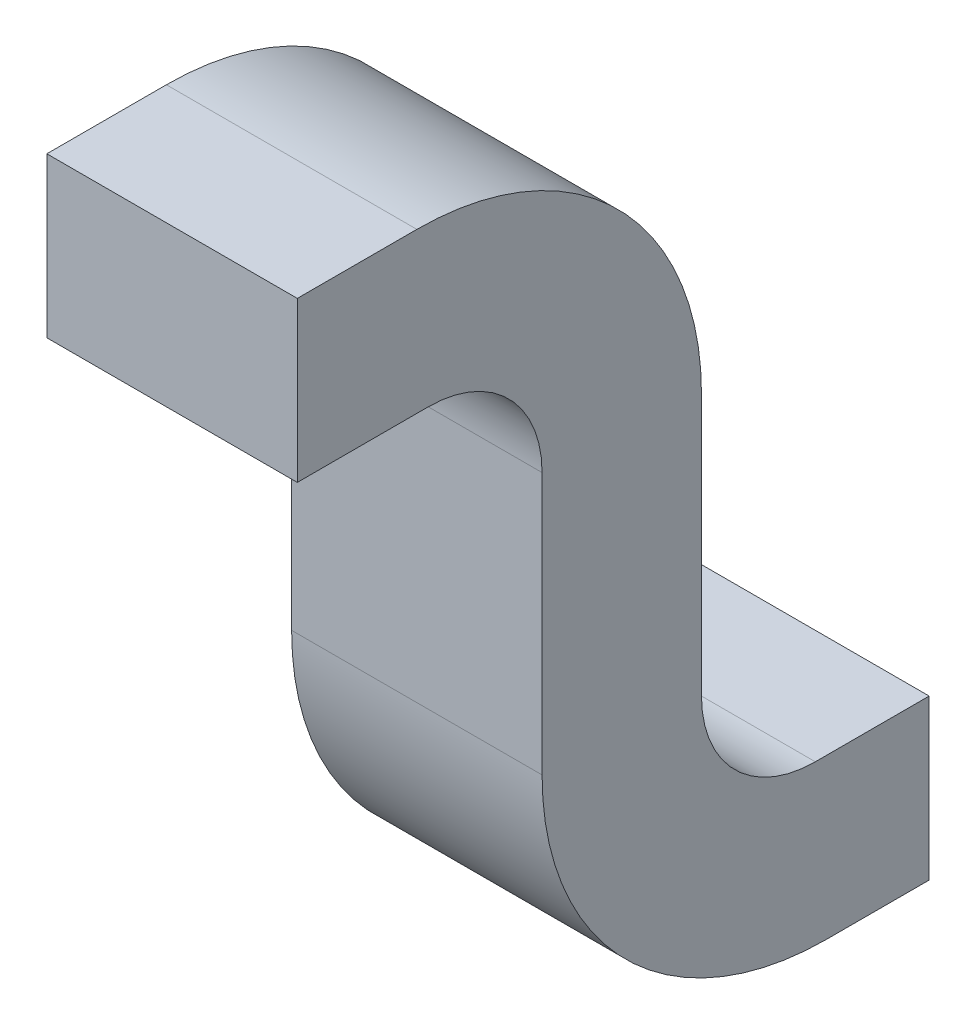
ISO-10303-21;
HEADER;
FILE_DESCRIPTION(('STEP AP214'),'2;1');
FILE_NAME('part.step','',(''),(''),'','','');
FILE_SCHEMA(('AUTOMOTIVE_DESIGN { 1 0 10303 214 1 1 1 1 }'));
ENDSEC;
DATA;
#1=APPLICATION_CONTEXT('core data for automotive mechanical design processes');
#2=APPLICATION_PROTOCOL_DEFINITION('international standard','automotive_design',2000,#1);
#3=PRODUCT_CONTEXT('',#1,'mechanical');
#4=PRODUCT('Part','Part','',(#3));
#5=PRODUCT_RELATED_PRODUCT_CATEGORY('part','',(#4));
#6=PRODUCT_DEFINITION_FORMATION('','',#4);
#7=PRODUCT_DEFINITION_CONTEXT('part definition',#1,'design');
#8=PRODUCT_DEFINITION('design','',#6,#7);
#9=PRODUCT_DEFINITION_SHAPE('','',#8);
#10=(LENGTH_UNIT() NAMED_UNIT(*) SI_UNIT(.MILLI.,.METRE.));
#11=(NAMED_UNIT(*) PLANE_ANGLE_UNIT() SI_UNIT($,.RADIAN.));
#12=(NAMED_UNIT(*) SI_UNIT($,.STERADIAN.) SOLID_ANGLE_UNIT());
#13=UNCERTAINTY_MEASURE_WITH_UNIT(LENGTH_MEASURE(1.E-05),#10,'distance_accuracy_value','');
#14=(GEOMETRIC_REPRESENTATION_CONTEXT(3) GLOBAL_UNCERTAINTY_ASSIGNED_CONTEXT((#13)) GLOBAL_UNIT_ASSIGNED_CONTEXT((#10,
#11,#12)) REPRESENTATION_CONTEXT('',''));
#15=CARTESIAN_POINT('',(0.,0.,0.));
#16=DIRECTION('',(0.,0.,1.));
#17=DIRECTION('',(1.,0.,0.));
#18=AXIS2_PLACEMENT_3D('',#15,#16,#17);
#19=CARTESIAN_POINT('',(0.76,0.165,-0.545));
#20=DIRECTION('',(1.,0.,0.));
#21=DIRECTION('',(0.,1.,0.));
#22=AXIS2_PLACEMENT_3D('',#19,#20,#21);
#23=PLANE('',#22);
#24=CARTESIAN_POINT('',(0.76,-0.235,-1.01));
#25=DIRECTION('',(1.,0.,0.));
#26=DIRECTION('',(0.,-1.,0.));
#27=AXIS2_PLACEMENT_3D('',#24,#25,#26);
#28=CIRCLE('',#27,0.25);
#29=CARTESIAN_POINT('',(0.76,-0.235,-0.76));
#30=VERTEX_POINT('',#29);
#31=CARTESIAN_POINT('',(0.76,-0.485,-1.01));
#32=VERTEX_POINT('',#31);
#33=EDGE_CURVE('E11',#30,#32,#28,.T.);
#34=ORIENTED_EDGE('',*,*,#33,.T.);
#35=DIRECTION('',(0.,0.,-1.));
#36=VECTOR('',#35,1.);
#37=CARTESIAN_POINT('',(0.76,-0.485,-0.545));
#38=LINE('',#37,#36);
#39=CARTESIAN_POINT('',(0.76,-0.485,-1.1));
#40=VERTEX_POINT('',#39);
#41=EDGE_CURVE('E169',#32,#40,#38,.T.);
#42=ORIENTED_EDGE('',*,*,#41,.T.);
#43=DIRECTION('',(0.,1.,0.));
#44=VECTOR('',#43,1.);
#45=CARTESIAN_POINT('',(0.76,0.165,-1.1));
#46=LINE('',#45,#44);
#47=CARTESIAN_POINT('',(0.76,-0.345,-1.1));
#48=VERTEX_POINT('',#47);
#49=EDGE_CURVE('E163',#40,#48,#46,.T.);
#50=ORIENTED_EDGE('',*,*,#49,.T.);
#51=DIRECTION('',(0.,0.,1.));
#52=VECTOR('',#51,1.);
#53=CARTESIAN_POINT('',(0.76,-0.345,-0.545));
#54=LINE('',#53,#52);
#55=CARTESIAN_POINT('',(0.76,-0.345,-1.));
#56=VERTEX_POINT('',#55);
#57=EDGE_CURVE('E104',#48,#56,#54,.T.);
#58=ORIENTED_EDGE('',*,*,#57,.T.);
#59=CARTESIAN_POINT('',(0.76,-0.245,-1.));
#60=DIRECTION('',(-1.,0.,0.));
#61=DIRECTION('',(0.,-1.,0.));
#62=AXIS2_PLACEMENT_3D('',#59,#60,#61);
#63=CIRCLE('',#62,0.1);
#64=CARTESIAN_POINT('',(0.76,-0.245,-0.9));
#65=VERTEX_POINT('',#64);
#66=EDGE_CURVE('E93',#56,#65,#63,.T.);
#67=ORIENTED_EDGE('',*,*,#66,.T.);
#68=DIRECTION('',(0.,1.,0.));
#69=VECTOR('',#68,1.);
#70=CARTESIAN_POINT('',(0.76,0.165,-0.9));
#71=LINE('',#70,#69);
#72=CARTESIAN_POINT('',(0.76,-0.01499999999999,-0.9));
#73=VERTEX_POINT('',#72);
#74=EDGE_CURVE('E208',#65,#73,#71,.T.);
#75=ORIENTED_EDGE('',*,*,#74,.T.);
#76=CARTESIAN_POINT('',(0.76,-0.01499999999999,-0.65));
#77=DIRECTION('',(1.,0.,0.));
#78=DIRECTION('',(0.,-1.,0.));
#79=AXIS2_PLACEMENT_3D('',#76,#77,#78);
#80=CIRCLE('',#79,0.25);
#81=CARTESIAN_POINT('',(0.76,0.235,-0.65));
#82=VERTEX_POINT('',#81);
#83=EDGE_CURVE('E207',#73,#82,#80,.T.);
#84=ORIENTED_EDGE('',*,*,#83,.T.);
#85=DIRECTION('',(0.,0.,1.));
#86=VECTOR('',#85,1.);
#87=CARTESIAN_POINT('',(0.76,0.235,-0.545));
#88=LINE('',#87,#86);
#89=CARTESIAN_POINT('',(0.76,0.235,-0.545));
#90=VERTEX_POINT('',#89);
#91=EDGE_CURVE('E264',#82,#90,#88,.T.);
#92=ORIENTED_EDGE('',*,*,#91,.T.);
#93=DIRECTION('',(0.,-1.,0.));
#94=VECTOR('',#93,1.);
#95=CARTESIAN_POINT('',(0.76,0.165,-0.545));
#96=LINE('',#95,#94);
#97=CARTESIAN_POINT('',(0.76,0.09500000000001,-0.545));
#98=VERTEX_POINT('',#97);
#99=EDGE_CURVE('E249',#90,#98,#96,.T.);
#100=ORIENTED_EDGE('',*,*,#99,.T.);
#101=DIRECTION('',(0.,0.,-1.));
#102=VECTOR('',#101,1.);
#103=CARTESIAN_POINT('',(0.76,0.09500000000001,-0.545));
#104=LINE('',#103,#102);
#105=CARTESIAN_POINT('',(0.76,0.09500000000001,-0.66));
#106=VERTEX_POINT('',#105);
#107=EDGE_CURVE('E217',#98,#106,#104,.T.);
#108=ORIENTED_EDGE('',*,*,#107,.T.);
#109=CARTESIAN_POINT('',(0.76,-0.004999999999992,-0.66));
#110=DIRECTION('',(-1.,0.,0.));
#111=DIRECTION('',(0.,-1.,0.));
#112=AXIS2_PLACEMENT_3D('',#109,#110,#111);
#113=CIRCLE('',#112,0.1);
#114=CARTESIAN_POINT('',(0.76,-0.004999999999989,-0.76));
#115=VERTEX_POINT('',#114);
#116=EDGE_CURVE('E232',#106,#115,#113,.T.);
#117=ORIENTED_EDGE('',*,*,#116,.T.);
#118=DIRECTION('',(0.,-1.,0.));
#119=VECTOR('',#118,1.);
#120=CARTESIAN_POINT('',(0.76,0.165,-0.76));
#121=LINE('',#120,#119);
#122=EDGE_CURVE('E27',#115,#30,#121,.T.);
#123=ORIENTED_EDGE('',*,*,#122,.T.);
#124=EDGE_LOOP('',(#34,#42,#50,#58,#67,#75,#84,#92,#100,#108,#117,#123));
#125=FACE_BOUND('',#124,.T.);
#126=ADVANCED_FACE('F16',(#125),#23,.T.);
#127=CARTESIAN_POINT('',(0.54,-0.235,-1.01));
#128=DIRECTION('',(-1.,0.,0.));
#129=DIRECTION('',(0.,-1.,0.));
#130=AXIS2_PLACEMENT_3D('',#127,#128,#129);
#131=CYLINDRICAL_SURFACE('',#130,0.25);
#132=DIRECTION('',(1.,0.,0.));
#133=VECTOR('',#132,1.);
#134=CARTESIAN_POINT('',(0.54,-0.485,-1.01));
#135=LINE('',#134,#133);
#136=CARTESIAN_POINT('',(0.54,-0.485,-1.01));
#137=VERTEX_POINT('',#136);
#138=EDGE_CURVE('E182',#137,#32,#135,.T.);
#139=ORIENTED_EDGE('',*,*,#138,.T.);
#140=ORIENTED_EDGE('',*,*,#33,.F.);
#141=DIRECTION('',(-1.,0.,0.));
#142=VECTOR('',#141,1.);
#143=CARTESIAN_POINT('',(0.54,-0.235,-0.76));
#144=LINE('',#143,#142);
#145=CARTESIAN_POINT('',(0.54,-0.235,-0.76));
#146=VERTEX_POINT('',#145);
#147=EDGE_CURVE('E148',#30,#146,#144,.T.);
#148=ORIENTED_EDGE('',*,*,#147,.T.);
#149=CARTESIAN_POINT('',(0.54,-0.235,-1.01));
#150=DIRECTION('',(1.,0.,0.));
#151=DIRECTION('',(0.,-1.,0.));
#152=AXIS2_PLACEMENT_3D('',#149,#150,#151);
#153=CIRCLE('',#152,0.25);
#154=EDGE_CURVE('E184',#146,#137,#153,.T.);
#155=ORIENTED_EDGE('',*,*,#154,.T.);
#156=EDGE_LOOP('',(#139,#140,#148,#155));
#157=FACE_BOUND('',#156,.T.);
#158=ADVANCED_FACE('F18',(#157),#131,.T.);
#159=CARTESIAN_POINT('',(0.54,-0.12,-0.76));
#160=DIRECTION('',(0.,0.,1.));
#161=DIRECTION('',(0.,-1.,0.));
#162=AXIS2_PLACEMENT_3D('',#159,#160,#161);
#163=PLANE('',#162);
#164=DIRECTION('',(0.,-1.,0.));
#165=VECTOR('',#164,1.);
#166=CARTESIAN_POINT('',(0.54,-0.12,-0.76));
#167=LINE('',#166,#165);
#168=CARTESIAN_POINT('',(0.54,-0.004999999999997,-0.76));
#169=VERTEX_POINT('',#168);
#170=EDGE_CURVE('E190',#169,#146,#167,.T.);
#171=ORIENTED_EDGE('',*,*,#170,.T.);
#172=ORIENTED_EDGE('',*,*,#147,.F.);
#173=ORIENTED_EDGE('',*,*,#122,.F.);
#174=DIRECTION('',(-1.,0.,0.));
#175=VECTOR('',#174,1.);
#176=CARTESIAN_POINT('',(0.54,-0.004999999999986,-0.76));
#177=LINE('',#176,#175);
#178=EDGE_CURVE('E221',#115,#169,#177,.T.);
#179=ORIENTED_EDGE('',*,*,#178,.T.);
#180=EDGE_LOOP('',(#171,#172,#173,#179));
#181=FACE_BOUND('',#180,.T.);
#182=ADVANCED_FACE('F286',(#181),#163,.T.);
#183=CARTESIAN_POINT('',(0.54,-0.005000000000009,-0.66));
#184=DIRECTION('',(-1.,0.,0.));
#185=DIRECTION('',(0.,-1.,0.));
#186=AXIS2_PLACEMENT_3D('',#183,#184,#185);
#187=CYLINDRICAL_SURFACE('',#186,0.1);
#188=DIRECTION('',(1.,0.,0.));
#189=VECTOR('',#188,1.);
#190=CARTESIAN_POINT('',(0.54,0.09499999999999,-0.66));
#191=LINE('',#190,#189);
#192=CARTESIAN_POINT('',(0.54,0.09499999999999,-0.66));
#193=VERTEX_POINT('',#192);
#194=EDGE_CURVE('E143',#193,#106,#191,.T.);
#195=ORIENTED_EDGE('',*,*,#194,.F.);
#196=CARTESIAN_POINT('',(0.54,-0.005000000000009,-0.66));
#197=DIRECTION('',(1.,0.,0.));
#198=DIRECTION('',(0.,-1.,0.));
#199=AXIS2_PLACEMENT_3D('',#196,#197,#198);
#200=CIRCLE('',#199,0.1);
#201=EDGE_CURVE('E20',#169,#193,#200,.T.);
#202=ORIENTED_EDGE('',*,*,#201,.F.);
#203=ORIENTED_EDGE('',*,*,#178,.F.);
#204=ORIENTED_EDGE('',*,*,#116,.F.);
#205=EDGE_LOOP('',(#195,#202,#203,#204));
#206=FACE_BOUND('',#205,.T.);
#207=ADVANCED_FACE('F298',(#206),#187,.F.);
#208=CARTESIAN_POINT('',(0.54,0.09499999999999,-0.6025));
#209=DIRECTION('',(0.,-1.,0.));
#210=DIRECTION('',(0.,0.,-1.));
#211=AXIS2_PLACEMENT_3D('',#208,#209,#210);
#212=PLANE('',#211);
#213=DIRECTION('',(0.,0.,-1.));
#214=VECTOR('',#213,1.);
#215=CARTESIAN_POINT('',(0.54,0.09499999999999,-0.6025));
#216=LINE('',#215,#214);
#217=CARTESIAN_POINT('',(0.54,0.09499999999999,-0.545));
#218=VERTEX_POINT('',#217);
#219=EDGE_CURVE('E194',#218,#193,#216,.T.);
#220=ORIENTED_EDGE('',*,*,#219,.T.);
#221=ORIENTED_EDGE('',*,*,#194,.T.);
#222=ORIENTED_EDGE('',*,*,#107,.F.);
#223=DIRECTION('',(-1.,0.,0.));
#224=VECTOR('',#223,1.);
#225=CARTESIAN_POINT('',(0.54,0.09499999999999,-0.545));
#226=LINE('',#225,#224);
#227=EDGE_CURVE('E132',#98,#218,#226,.T.);
#228=ORIENTED_EDGE('',*,*,#227,.T.);
#229=EDGE_LOOP('',(#220,#221,#222,#228));
#230=FACE_BOUND('',#229,.T.);
#231=ADVANCED_FACE('F317',(#230),#212,.T.);
#232=CARTESIAN_POINT('',(0.54,0.165,-0.545));
#233=DIRECTION('',(0.,0.,1.));
#234=DIRECTION('',(0.,-1.,0.));
#235=AXIS2_PLACEMENT_3D('',#232,#233,#234);
#236=PLANE('',#235);
#237=DIRECTION('',(0.,-1.,0.));
#238=VECTOR('',#237,1.);
#239=CARTESIAN_POINT('',(0.54,0.165,-0.545));
#240=LINE('',#239,#238);
#241=CARTESIAN_POINT('',(0.54,0.235,-0.545));
#242=VERTEX_POINT('',#241);
#243=EDGE_CURVE('E197',#242,#218,#240,.T.);
#244=ORIENTED_EDGE('',*,*,#243,.T.);
#245=ORIENTED_EDGE('',*,*,#227,.F.);
#246=ORIENTED_EDGE('',*,*,#99,.F.);
#247=DIRECTION('',(-1.,0.,0.));
#248=VECTOR('',#247,1.);
#249=CARTESIAN_POINT('',(0.54,0.235,-0.545));
#250=LINE('',#249,#248);
#251=EDGE_CURVE('E238',#90,#242,#250,.T.);
#252=ORIENTED_EDGE('',*,*,#251,.T.);
#253=EDGE_LOOP('',(#244,#245,#246,#252));
#254=FACE_BOUND('',#253,.T.);
#255=ADVANCED_FACE('F315',(#254),#236,.T.);
#256=CARTESIAN_POINT('',(0.54,0.235,-0.5975));
#257=DIRECTION('',(0.,1.,0.));
#258=DIRECTION('',(1.,0.,0.));
#259=AXIS2_PLACEMENT_3D('',#256,#257,#258);
#260=PLANE('',#259);
#261=DIRECTION('',(0.,0.,1.));
#262=VECTOR('',#261,1.);
#263=CARTESIAN_POINT('',(0.54,0.235,-0.5975));
#264=LINE('',#263,#262);
#265=CARTESIAN_POINT('',(0.54,0.235,-0.65));
#266=VERTEX_POINT('',#265);
#267=EDGE_CURVE('E202',#266,#242,#264,.T.);
#268=ORIENTED_EDGE('',*,*,#267,.T.);
#269=ORIENTED_EDGE('',*,*,#251,.F.);
#270=ORIENTED_EDGE('',*,*,#91,.F.);
#271=DIRECTION('',(-1.,0.,0.));
#272=VECTOR('',#271,1.);
#273=CARTESIAN_POINT('',(0.54,0.235,-0.65));
#274=LINE('',#273,#272);
#275=EDGE_CURVE('E204',#82,#266,#274,.T.);
#276=ORIENTED_EDGE('',*,*,#275,.T.);
#277=EDGE_LOOP('',(#268,#269,#270,#276));
#278=FACE_BOUND('',#277,.T.);
#279=ADVANCED_FACE('F305',(#278),#260,.T.);
#280=CARTESIAN_POINT('',(0.54,-0.01500000000001,-0.65));
#281=DIRECTION('',(-1.,0.,0.));
#282=DIRECTION('',(0.,-1.,0.));
#283=AXIS2_PLACEMENT_3D('',#280,#281,#282);
#284=CYLINDRICAL_SURFACE('',#283,0.25);
#285=ORIENTED_EDGE('',*,*,#275,.F.);
#286=ORIENTED_EDGE('',*,*,#83,.F.);
#287=DIRECTION('',(-1.,0.,0.));
#288=VECTOR('',#287,1.);
#289=CARTESIAN_POINT('',(0.54,-0.015,-0.9));
#290=LINE('',#289,#288);
#291=CARTESIAN_POINT('',(0.54,-0.015,-0.9));
#292=VERTEX_POINT('',#291);
#293=EDGE_CURVE('E214',#73,#292,#290,.T.);
#294=ORIENTED_EDGE('',*,*,#293,.T.);
#295=CARTESIAN_POINT('',(0.54,-0.01500000000001,-0.65));
#296=DIRECTION('',(1.,0.,0.));
#297=DIRECTION('',(0.,-1.,0.));
#298=AXIS2_PLACEMENT_3D('',#295,#296,#297);
#299=CIRCLE('',#298,0.25);
#300=EDGE_CURVE('E198',#292,#266,#299,.T.);
#301=ORIENTED_EDGE('',*,*,#300,.T.);
#302=EDGE_LOOP('',(#285,#286,#294,#301));
#303=FACE_BOUND('',#302,.T.);
#304=ADVANCED_FACE('F310',(#303),#284,.T.);
#305=CARTESIAN_POINT('',(0.54,-0.13,-0.9));
#306=DIRECTION('',(0.,0.,-1.));
#307=DIRECTION('',(-1.,0.,0.));
#308=AXIS2_PLACEMENT_3D('',#305,#306,#307);
#309=PLANE('',#308);
#310=DIRECTION('',(0.,1.,0.));
#311=VECTOR('',#310,1.);
#312=CARTESIAN_POINT('',(0.54,-0.13,-0.9));
#313=LINE('',#312,#311);
#314=CARTESIAN_POINT('',(0.54,-0.245,-0.9));
#315=VERTEX_POINT('',#314);
#316=EDGE_CURVE('E201',#315,#292,#313,.T.);
#317=ORIENTED_EDGE('',*,*,#316,.T.);
#318=ORIENTED_EDGE('',*,*,#293,.F.);
#319=ORIENTED_EDGE('',*,*,#74,.F.);
#320=DIRECTION('',(-1.,0.,0.));
#321=VECTOR('',#320,1.);
#322=CARTESIAN_POINT('',(0.54,-0.245,-0.9));
#323=LINE('',#322,#321);
#324=EDGE_CURVE('E246',#65,#315,#323,.T.);
#325=ORIENTED_EDGE('',*,*,#324,.T.);
#326=EDGE_LOOP('',(#317,#318,#319,#325));
#327=FACE_BOUND('',#326,.T.);
#328=ADVANCED_FACE('F312',(#327),#309,.T.);
#329=CARTESIAN_POINT('',(0.54,-0.245,-1.));
#330=DIRECTION('',(-1.,0.,0.));
#331=DIRECTION('',(0.,-1.,0.));
#332=AXIS2_PLACEMENT_3D('',#329,#330,#331);
#333=CYLINDRICAL_SURFACE('',#332,0.1);
#334=DIRECTION('',(1.,0.,0.));
#335=VECTOR('',#334,1.);
#336=CARTESIAN_POINT('',(0.54,-0.345,-1.));
#337=LINE('',#336,#335);
#338=CARTESIAN_POINT('',(0.54,-0.345,-1.));
#339=VERTEX_POINT('',#338);
#340=EDGE_CURVE('E252',#339,#56,#337,.T.);
#341=ORIENTED_EDGE('',*,*,#340,.F.);
#342=CARTESIAN_POINT('',(0.54,-0.245,-1.));
#343=DIRECTION('',(1.,0.,0.));
#344=DIRECTION('',(0.,-1.,0.));
#345=AXIS2_PLACEMENT_3D('',#342,#343,#344);
#346=CIRCLE('',#345,0.1);
#347=EDGE_CURVE('E211',#315,#339,#346,.T.);
#348=ORIENTED_EDGE('',*,*,#347,.F.);
#349=ORIENTED_EDGE('',*,*,#324,.F.);
#350=ORIENTED_EDGE('',*,*,#66,.F.);
#351=EDGE_LOOP('',(#341,#348,#349,#350));
#352=FACE_BOUND('',#351,.T.);
#353=ADVANCED_FACE('F320',(#352),#333,.F.);
#354=CARTESIAN_POINT('',(0.54,-0.345,-1.05));
#355=DIRECTION('',(0.,1.,0.));
#356=DIRECTION('',(1.,0.,0.));
#357=AXIS2_PLACEMENT_3D('',#354,#355,#356);
#358=PLANE('',#357);
#359=DIRECTION('',(0.,0.,1.));
#360=VECTOR('',#359,1.);
#361=CARTESIAN_POINT('',(0.54,-0.345,-1.05));
#362=LINE('',#361,#360);
#363=CARTESIAN_POINT('',(0.54,-0.345,-1.1));
#364=VERTEX_POINT('',#363);
#365=EDGE_CURVE('E178',#364,#339,#362,.T.);
#366=ORIENTED_EDGE('',*,*,#365,.T.);
#367=ORIENTED_EDGE('',*,*,#340,.T.);
#368=ORIENTED_EDGE('',*,*,#57,.F.);
#369=DIRECTION('',(-1.,0.,0.));
#370=VECTOR('',#369,1.);
#371=CARTESIAN_POINT('',(0.54,-0.345,-1.1));
#372=LINE('',#371,#370);
#373=EDGE_CURVE('E224',#48,#364,#372,.T.);
#374=ORIENTED_EDGE('',*,*,#373,.T.);
#375=EDGE_LOOP('',(#366,#367,#368,#374));
#376=FACE_BOUND('',#375,.T.);
#377=ADVANCED_FACE('F309',(#376),#358,.T.);
#378=CARTESIAN_POINT('',(0.54,-0.415,-1.1));
#379=DIRECTION('',(0.,0.,-1.));
#380=DIRECTION('',(-1.,0.,0.));
#381=AXIS2_PLACEMENT_3D('',#378,#379,#380);
#382=PLANE('',#381);
#383=DIRECTION('',(0.,1.,0.));
#384=VECTOR('',#383,1.);
#385=CARTESIAN_POINT('',(0.54,-0.415,-1.1));
#386=LINE('',#385,#384);
#387=CARTESIAN_POINT('',(0.54,-0.485,-1.1));
#388=VERTEX_POINT('',#387);
#389=EDGE_CURVE('E161',#388,#364,#386,.T.);
#390=ORIENTED_EDGE('',*,*,#389,.T.);
#391=ORIENTED_EDGE('',*,*,#373,.F.);
#392=ORIENTED_EDGE('',*,*,#49,.F.);
#393=DIRECTION('',(-1.,0.,0.));
#394=VECTOR('',#393,1.);
#395=CARTESIAN_POINT('',(0.54,-0.485,-1.1));
#396=LINE('',#395,#394);
#397=EDGE_CURVE('E157',#40,#388,#396,.T.);
#398=ORIENTED_EDGE('',*,*,#397,.T.);
#399=EDGE_LOOP('',(#390,#391,#392,#398));
#400=FACE_BOUND('',#399,.T.);
#401=ADVANCED_FACE('F159',(#400),#382,.T.);
#402=CARTESIAN_POINT('',(0.54,-0.485,-1.055));
#403=DIRECTION('',(0.,-1.,0.));
#404=DIRECTION('',(0.,0.,-1.));
#405=AXIS2_PLACEMENT_3D('',#402,#403,#404);
#406=PLANE('',#405);
#407=DIRECTION('',(0.,0.,-1.));
#408=VECTOR('',#407,1.);
#409=CARTESIAN_POINT('',(0.54,-0.485,-1.055));
#410=LINE('',#409,#408);
#411=EDGE_CURVE('E175',#137,#388,#410,.T.);
#412=ORIENTED_EDGE('',*,*,#411,.T.);
#413=ORIENTED_EDGE('',*,*,#397,.F.);
#414=ORIENTED_EDGE('',*,*,#41,.F.);
#415=ORIENTED_EDGE('',*,*,#138,.F.);
#416=EDGE_LOOP('',(#412,#413,#414,#415));
#417=FACE_BOUND('',#416,.T.);
#418=ADVANCED_FACE('F181',(#417),#406,.T.);
#419=CARTESIAN_POINT('',(0.54,-0.121132572617,-0.825365755119));
#420=DIRECTION('',(1.,0.,0.));
#421=DIRECTION('',(0.,0.,1.));
#422=AXIS2_PLACEMENT_3D('',#419,#420,#421);
#423=PLANE('',#422);
#424=ORIENTED_EDGE('',*,*,#411,.F.);
#425=ORIENTED_EDGE('',*,*,#154,.F.);
#426=ORIENTED_EDGE('',*,*,#170,.F.);
#427=ORIENTED_EDGE('',*,*,#201,.T.);
#428=ORIENTED_EDGE('',*,*,#219,.F.);
#429=ORIENTED_EDGE('',*,*,#243,.F.);
#430=ORIENTED_EDGE('',*,*,#267,.F.);
#431=ORIENTED_EDGE('',*,*,#300,.F.);
#432=ORIENTED_EDGE('',*,*,#316,.F.);
#433=ORIENTED_EDGE('',*,*,#347,.T.);
#434=ORIENTED_EDGE('',*,*,#365,.F.);
#435=ORIENTED_EDGE('',*,*,#389,.F.);
#436=EDGE_LOOP('',(#424,#425,#426,#427,#428,#429,#430,#431,#432,#433,#434,#435));
#437=FACE_BOUND('',#436,.T.);
#438=ADVANCED_FACE('F173',(#437),#423,.F.);
#439=CLOSED_SHELL('',(#126,#158,#182,#207,#231,#255,#279,#304,#328,#353,#377,#401,#418,#438));
#440=MANIFOLD_SOLID_BREP('B1',#439);
#441=ADVANCED_BREP_SHAPE_REPRESENTATION('',(#18,#440),#14);
#442=SHAPE_DEFINITION_REPRESENTATION(#9,#441);
ENDSEC;
END-ISO-10303-21;
